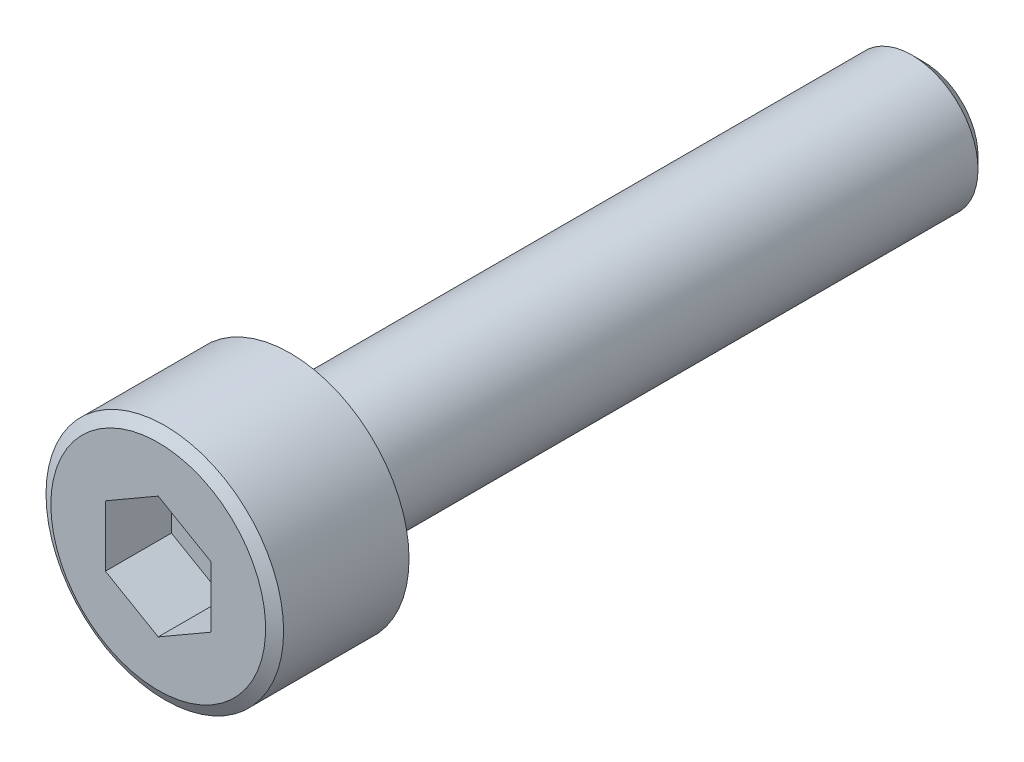
ISO-10303-21;
HEADER;
FILE_DESCRIPTION(('STEP AP214'),'2;1');
FILE_NAME('part.step','',(''),(''),'','','');
FILE_SCHEMA(('AUTOMOTIVE_DESIGN { 1 0 10303 214 1 1 1 1 }'));
ENDSEC;
DATA;
#1=APPLICATION_CONTEXT('core data for automotive mechanical design processes');
#2=APPLICATION_PROTOCOL_DEFINITION('international standard','automotive_design',2000,#1);
#3=PRODUCT_CONTEXT('',#1,'mechanical');
#4=PRODUCT('Part','Part','',(#3));
#5=PRODUCT_RELATED_PRODUCT_CATEGORY('part','',(#4));
#6=PRODUCT_DEFINITION_FORMATION('','',#4);
#7=PRODUCT_DEFINITION_CONTEXT('part definition',#1,'design');
#8=PRODUCT_DEFINITION('design','',#6,#7);
#9=PRODUCT_DEFINITION_SHAPE('','',#8);
#10=(LENGTH_UNIT() NAMED_UNIT(*) SI_UNIT(.MILLI.,.METRE.));
#11=(NAMED_UNIT(*) PLANE_ANGLE_UNIT() SI_UNIT($,.RADIAN.));
#12=(NAMED_UNIT(*) SI_UNIT($,.STERADIAN.) SOLID_ANGLE_UNIT());
#13=UNCERTAINTY_MEASURE_WITH_UNIT(LENGTH_MEASURE(1.E-05),#10,'distance_accuracy_value','');
#14=(GEOMETRIC_REPRESENTATION_CONTEXT(3) GLOBAL_UNCERTAINTY_ASSIGNED_CONTEXT((#13)) GLOBAL_UNIT_ASSIGNED_CONTEXT((#10,
#11,#12)) REPRESENTATION_CONTEXT('',''));
#15=CARTESIAN_POINT('',(0.,0.,0.));
#16=DIRECTION('',(0.,0.,1.));
#17=DIRECTION('',(1.,0.,0.));
#18=AXIS2_PLACEMENT_3D('',#15,#16,#17);
#19=CARTESIAN_POINT('',(0.,0.,1.25));
#20=DIRECTION('',(0.,0.,1.));
#21=DIRECTION('',(1.,0.,0.));
#22=AXIS2_PLACEMENT_3D('',#19,#20,#21);
#23=PLANE('',#22);
#24=DIRECTION('',(-0.866025403784429,0.500000000000017,0.));
#25=VECTOR('',#24,1.);
#26=CARTESIAN_POINT('',(1.,0.5773502691896,1.25));
#27=LINE('',#26,#25);
#28=CARTESIAN_POINT('',(1.,0.5773502691896,1.25));
#29=VERTEX_POINT('',#28);
#30=CARTESIAN_POINT('',(0.,1.15470053837905,1.25));
#31=VERTEX_POINT('',#30);
#32=EDGE_CURVE('E74',#29,#31,#27,.T.);
#33=ORIENTED_EDGE('',*,*,#32,.T.);
#34=DIRECTION('',(-0.866025403784429,-0.500000000000017,0.));
#35=VECTOR('',#34,1.);
#36=CARTESIAN_POINT('',(0.,1.154700538379,1.25));
#37=LINE('',#36,#35);
#38=CARTESIAN_POINT('',(-0.999999999999946,0.577350269189506,1.25));
#39=VERTEX_POINT('',#38);
#40=EDGE_CURVE('E71',#31,#39,#37,.T.);
#41=ORIENTED_EDGE('',*,*,#40,.T.);
#42=DIRECTION('',(0.,1.,0.));
#43=VECTOR('',#42,1.);
#44=CARTESIAN_POINT('',(-1.,0.5773502691896,1.25));
#45=LINE('',#44,#43);
#46=CARTESIAN_POINT('',(-1.,-0.5773502691896,1.25));
#47=VERTEX_POINT('',#46);
#48=EDGE_CURVE('E68',#39,#47,#45,.F.);
#49=ORIENTED_EDGE('',*,*,#48,.T.);
#50=DIRECTION('',(0.866025403784429,-0.500000000000017,0.));
#51=VECTOR('',#50,1.);
#52=CARTESIAN_POINT('',(-1.,-0.5773502691896,1.25));
#53=LINE('',#52,#51);
#54=CARTESIAN_POINT('',(0.,-1.15470053837909,1.25));
#55=VERTEX_POINT('',#54);
#56=EDGE_CURVE('E91',#47,#55,#53,.T.);
#57=ORIENTED_EDGE('',*,*,#56,.T.);
#58=DIRECTION('',(0.866025403784429,0.500000000000017,0.));
#59=VECTOR('',#58,1.);
#60=CARTESIAN_POINT('',(0.,-1.154700538379,1.25));
#61=LINE('',#60,#59);
#62=CARTESIAN_POINT('',(0.999999999999946,-0.577350269189506,1.25));
#63=VERTEX_POINT('',#62);
#64=EDGE_CURVE('E130',#55,#63,#61,.T.);
#65=ORIENTED_EDGE('',*,*,#64,.T.);
#66=DIRECTION('',(0.,1.,0.));
#67=VECTOR('',#66,1.);
#68=CARTESIAN_POINT('',(1.,-0.5773502691896,1.25));
#69=LINE('',#68,#67);
#70=EDGE_CURVE('E125',#63,#29,#69,.T.);
#71=ORIENTED_EDGE('',*,*,#70,.T.);
#72=EDGE_LOOP('',(#33,#41,#49,#57,#65,#71));
#73=FACE_BOUND('',#72,.T.);
#74=ADVANCED_FACE('F17',(#73),#23,.T.);
#75=CARTESIAN_POINT('',(0.,1.154700538379,2.5));
#76=DIRECTION('',(-0.500000000000017,0.866025403784429,0.));
#77=DIRECTION('',(-0.866025403784429,-0.500000000000017,0.));
#78=AXIS2_PLACEMENT_3D('',#75,#76,#77);
#79=PLANE('',#78);
#80=ORIENTED_EDGE('',*,*,#40,.F.);
#81=DIRECTION('',(0.,0.,1.));
#82=VECTOR('',#81,1.);
#83=CARTESIAN_POINT('',(1.08637057683048E-13,1.15470053837919,2.5));
#84=LINE('',#83,#82);
#85=CARTESIAN_POINT('',(0.,1.15470053837905,2.5));
#86=VERTEX_POINT('',#85);
#87=EDGE_CURVE('E120',#31,#86,#84,.T.);
#88=ORIENTED_EDGE('',*,*,#87,.T.);
#89=DIRECTION('',(-0.866025403784523,-0.499999999999853,0.));
#90=VECTOR('',#89,1.);
#91=CARTESIAN_POINT('',(0.,1.154700538379,2.5));
#92=LINE('',#91,#90);
#93=CARTESIAN_POINT('',(-0.999999999999946,0.577350269189506,2.5));
#94=VERTEX_POINT('',#93);
#95=EDGE_CURVE('E82',#86,#94,#92,.T.);
#96=ORIENTED_EDGE('',*,*,#95,.T.);
#97=DIRECTION('',(0.,0.,1.));
#98=VECTOR('',#97,1.);
#99=CARTESIAN_POINT('',(-1.,0.5773502691896,2.5));
#100=LINE('',#99,#98);
#101=EDGE_CURVE('E77',#94,#39,#100,.F.);
#102=ORIENTED_EDGE('',*,*,#101,.T.);
#103=EDGE_LOOP('',(#80,#88,#96,#102));
#104=FACE_BOUND('',#103,.T.);
#105=ADVANCED_FACE('F80',(#104),#79,.F.);
#106=CARTESIAN_POINT('',(-1.,0.5773502691896,2.5));
#107=DIRECTION('',(-1.,0.,0.));
#108=DIRECTION('',(0.,0.,1.));
#109=AXIS2_PLACEMENT_3D('',#106,#107,#108);
#110=PLANE('',#109);
#111=ORIENTED_EDGE('',*,*,#48,.F.);
#112=ORIENTED_EDGE('',*,*,#101,.F.);
#113=DIRECTION('',(0.,1.,0.));
#114=VECTOR('',#113,1.);
#115=CARTESIAN_POINT('',(-1.,0.,2.5));
#116=LINE('',#115,#114);
#117=CARTESIAN_POINT('',(-1.,-0.5773502691896,2.5));
#118=VERTEX_POINT('',#117);
#119=EDGE_CURVE('E117',#94,#118,#116,.F.);
#120=ORIENTED_EDGE('',*,*,#119,.T.);
#121=DIRECTION('',(0.,0.,1.));
#122=VECTOR('',#121,1.);
#123=CARTESIAN_POINT('',(-1.,-0.5773502691896,2.5));
#124=LINE('',#123,#122);
#125=EDGE_CURVE('E88',#118,#47,#124,.F.);
#126=ORIENTED_EDGE('',*,*,#125,.T.);
#127=EDGE_LOOP('',(#111,#112,#120,#126));
#128=FACE_BOUND('',#127,.T.);
#129=ADVANCED_FACE('F86',(#128),#110,.F.);
#130=CARTESIAN_POINT('',(-1.,-0.5773502691896,2.5));
#131=DIRECTION('',(-0.500000000000017,-0.866025403784429,0.));
#132=DIRECTION('',(0.866025403784429,-0.500000000000017,0.));
#133=AXIS2_PLACEMENT_3D('',#130,#131,#132);
#134=PLANE('',#133);
#135=ORIENTED_EDGE('',*,*,#56,.F.);
#136=ORIENTED_EDGE('',*,*,#125,.F.);
#137=DIRECTION('',(0.866025403784523,-0.499999999999853,0.));
#138=VECTOR('',#137,1.);
#139=CARTESIAN_POINT('',(-1.,-0.5773502691896,2.5));
#140=LINE('',#139,#138);
#141=CARTESIAN_POINT('',(0.,-1.15470053837909,2.5));
#142=VERTEX_POINT('',#141);
#143=EDGE_CURVE('E115',#118,#142,#140,.T.);
#144=ORIENTED_EDGE('',*,*,#143,.T.);
#145=DIRECTION('',(0.,0.,1.));
#146=VECTOR('',#145,1.);
#147=CARTESIAN_POINT('',(0.,-1.154700538379,2.5));
#148=LINE('',#147,#146);
#149=EDGE_CURVE('E132',#142,#55,#148,.F.);
#150=ORIENTED_EDGE('',*,*,#149,.T.);
#151=EDGE_LOOP('',(#135,#136,#144,#150));
#152=FACE_BOUND('',#151,.T.);
#153=ADVANCED_FACE('F137',(#152),#134,.F.);
#154=CARTESIAN_POINT('',(0.,-1.154700538379,2.5));
#155=DIRECTION('',(0.500000000000017,-0.866025403784429,0.));
#156=DIRECTION('',(0.866025403784429,0.500000000000017,0.));
#157=AXIS2_PLACEMENT_3D('',#154,#155,#156);
#158=PLANE('',#157);
#159=ORIENTED_EDGE('',*,*,#64,.F.);
#160=ORIENTED_EDGE('',*,*,#149,.F.);
#161=DIRECTION('',(0.866025403784523,0.499999999999853,0.));
#162=VECTOR('',#161,1.);
#163=CARTESIAN_POINT('',(0.,-1.154700538379,2.5));
#164=LINE('',#163,#162);
#165=CARTESIAN_POINT('',(0.999999999999946,-0.577350269189506,2.5));
#166=VERTEX_POINT('',#165);
#167=EDGE_CURVE('E113',#142,#166,#164,.T.);
#168=ORIENTED_EDGE('',*,*,#167,.T.);
#169=DIRECTION('',(0.,0.,-1.));
#170=VECTOR('',#169,1.);
#171=CARTESIAN_POINT('',(1.,-0.5773502691896,2.5));
#172=LINE('',#171,#170);
#173=EDGE_CURVE('E127',#166,#63,#172,.T.);
#174=ORIENTED_EDGE('',*,*,#173,.T.);
#175=EDGE_LOOP('',(#159,#160,#168,#174));
#176=FACE_BOUND('',#175,.T.);
#177=ADVANCED_FACE('F141',(#176),#158,.F.);
#178=CARTESIAN_POINT('',(1.,-0.5773502691896,2.5));
#179=DIRECTION('',(1.,0.,0.));
#180=DIRECTION('',(0.,0.,-1.));
#181=AXIS2_PLACEMENT_3D('',#178,#179,#180);
#182=PLANE('',#181);
#183=ORIENTED_EDGE('',*,*,#70,.F.);
#184=ORIENTED_EDGE('',*,*,#173,.F.);
#185=DIRECTION('',(0.,1.,0.));
#186=VECTOR('',#185,1.);
#187=CARTESIAN_POINT('',(1.,0.,2.5));
#188=LINE('',#187,#186);
#189=CARTESIAN_POINT('',(1.,0.5773502691896,2.5));
#190=VERTEX_POINT('',#189);
#191=EDGE_CURVE('E35',#166,#190,#188,.T.);
#192=ORIENTED_EDGE('',*,*,#191,.T.);
#193=DIRECTION('',(0.,0.,1.));
#194=VECTOR('',#193,1.);
#195=CARTESIAN_POINT('',(1.,0.5773502691896,2.5));
#196=LINE('',#195,#194);
#197=EDGE_CURVE('E123',#190,#29,#196,.F.);
#198=ORIENTED_EDGE('',*,*,#197,.T.);
#199=EDGE_LOOP('',(#183,#184,#192,#198));
#200=FACE_BOUND('',#199,.T.);
#201=ADVANCED_FACE('F143',(#200),#182,.F.);
#202=CARTESIAN_POINT('',(1.,0.5773502691896,2.5));
#203=DIRECTION('',(0.500000000000017,0.866025403784429,0.));
#204=DIRECTION('',(-0.866025403784429,0.500000000000017,0.));
#205=AXIS2_PLACEMENT_3D('',#202,#203,#204);
#206=PLANE('',#205);
#207=ORIENTED_EDGE('',*,*,#32,.F.);
#208=ORIENTED_EDGE('',*,*,#197,.F.);
#209=DIRECTION('',(-0.866025403784523,0.499999999999853,0.));
#210=VECTOR('',#209,1.);
#211=CARTESIAN_POINT('',(1.,0.5773502691896,2.5));
#212=LINE('',#211,#210);
#213=EDGE_CURVE('E107',#190,#86,#212,.T.);
#214=ORIENTED_EDGE('',*,*,#213,.T.);
#215=ORIENTED_EDGE('',*,*,#87,.F.);
#216=EDGE_LOOP('',(#207,#208,#214,#215));
#217=FACE_BOUND('',#216,.T.);
#218=ADVANCED_FACE('F146',(#217),#206,.F.);
#219=CARTESIAN_POINT('',(0.,0.,2.5));
#220=DIRECTION('',(0.,0.,-1.));
#221=DIRECTION('',(-1.,0.,0.));
#222=AXIS2_PLACEMENT_3D('',#219,#220,#221);
#223=PLANE('',#222);
#224=ORIENTED_EDGE('',*,*,#191,.F.);
#225=ORIENTED_EDGE('',*,*,#167,.F.);
#226=ORIENTED_EDGE('',*,*,#143,.F.);
#227=ORIENTED_EDGE('',*,*,#119,.F.);
#228=ORIENTED_EDGE('',*,*,#95,.F.);
#229=ORIENTED_EDGE('',*,*,#213,.F.);
#230=EDGE_LOOP('',(#224,#225,#226,#227,#228,#229));
#231=FACE_BOUND('',#230,.T.);
#232=CARTESIAN_POINT('',(0.,0.,2.49999999993209));
#233=DIRECTION('',(0.,0.,-1.));
#234=DIRECTION('',(-1.,0.,0.));
#235=AXIS2_PLACEMENT_3D('',#232,#233,#234);
#236=CIRCLE('',#235,2.03349364903715);
#237=CARTESIAN_POINT('',(-2.03349364903715,0.,2.49999999993209));
#238=VERTEX_POINT('',#237);
#239=EDGE_CURVE('E20',#238,#238,#236,.T.);
#240=ORIENTED_EDGE('',*,*,#239,.F.);
#241=EDGE_LOOP('',(#240));
#242=FACE_BOUND('',#241,.T.);
#243=ADVANCED_FACE('F148',(#231,#242),#223,.F.);
#244=CARTESIAN_POINT('',(0.,0.,2.3750000000291));
#245=DIRECTION('',(0.,0.,-1.));
#246=DIRECTION('',(-1.,0.,0.));
#247=AXIS2_PLACEMENT_3D('',#244,#245,#246);
#248=CONICAL_SURFACE('',#247,2.24999999983311,1.04719755123235);
#249=ORIENTED_EDGE('',*,*,#239,.T.);
#250=EDGE_LOOP('',(#249));
#251=FACE_BOUND('',#250,.T.);
#252=CARTESIAN_POINT('',(0.,0.,2.375));
#253=DIRECTION('',(0.,0.,-1.));
#254=DIRECTION('',(-1.,0.,0.));
#255=AXIS2_PLACEMENT_3D('',#252,#253,#254);
#256=CIRCLE('',#255,2.25);
#257=CARTESIAN_POINT('',(-2.25,0.,2.375));
#258=VERTEX_POINT('',#257);
#259=EDGE_CURVE('E99',#258,#258,#256,.T.);
#260=ORIENTED_EDGE('',*,*,#259,.F.);
#261=EDGE_LOOP('',(#260));
#262=FACE_BOUND('',#261,.T.);
#263=ADVANCED_FACE('F151',(#251,#262),#248,.T.);
#264=CARTESIAN_POINT('',(0.,0.,3.225));
#265=DIRECTION('',(0.,0.,-1.));
#266=DIRECTION('',(-1.,0.,0.));
#267=AXIS2_PLACEMENT_3D('',#264,#265,#266);
#268=CYLINDRICAL_SURFACE('',#267,2.25);
#269=CARTESIAN_POINT('',(0.,0.,0.));
#270=DIRECTION('',(0.,0.,-1.));
#271=DIRECTION('',(-1.,0.,0.));
#272=AXIS2_PLACEMENT_3D('',#269,#270,#271);
#273=CIRCLE('',#272,2.25);
#274=CARTESIAN_POINT('',(-2.25,0.,0.));
#275=VERTEX_POINT('',#274);
#276=EDGE_CURVE('E97',#275,#275,#273,.T.);
#277=ORIENTED_EDGE('',*,*,#276,.F.);
#278=EDGE_LOOP('',(#277));
#279=FACE_BOUND('',#278,.T.);
#280=ORIENTED_EDGE('',*,*,#259,.T.);
#281=EDGE_LOOP('',(#280));
#282=FACE_BOUND('',#281,.T.);
#283=ADVANCED_FACE('F157',(#279,#282),#268,.T.);
#284=CARTESIAN_POINT('',(0.,0.,-12.));
#285=DIRECTION('',(0.,0.,-1.));
#286=DIRECTION('',(-1.,0.,0.));
#287=AXIS2_PLACEMENT_3D('',#284,#285,#286);
#288=PLANE('',#287);
#289=CARTESIAN_POINT('',(0.,0.,-12.0000000000005));
#290=DIRECTION('',(0.,0.,1.));
#291=DIRECTION('',(1.,0.,0.));
#292=AXIS2_PLACEMENT_3D('',#289,#290,#291);
#293=CIRCLE('',#292,1.02500000002692);
#294=CARTESIAN_POINT('',(1.02500000002692,0.,-12.0000000000005));
#295=VERTEX_POINT('',#294);
#296=EDGE_CURVE('E95',#295,#295,#293,.T.);
#297=ORIENTED_EDGE('',*,*,#296,.F.);
#298=EDGE_LOOP('',(#297));
#299=FACE_BOUND('',#298,.T.);
#300=ADVANCED_FACE('F163',(#299),#288,.T.);
#301=CARTESIAN_POINT('',(0.,0.,0.));
#302=DIRECTION('',(0.,0.,-1.));
#303=DIRECTION('',(-1.,0.,0.));
#304=AXIS2_PLACEMENT_3D('',#301,#302,#303);
#305=PLANE('',#304);
#306=CARTESIAN_POINT('',(0.,0.,0.));
#307=DIRECTION('',(0.,0.,-1.));
#308=DIRECTION('',(-1.,0.,0.));
#309=AXIS2_PLACEMENT_3D('',#306,#307,#308);
#310=CIRCLE('',#309,1.25);
#311=CARTESIAN_POINT('',(-1.25,0.,0.));
#312=VERTEX_POINT('',#311);
#313=EDGE_CURVE('E11',#312,#312,#310,.T.);
#314=ORIENTED_EDGE('',*,*,#313,.F.);
#315=EDGE_LOOP('',(#314));
#316=FACE_BOUND('',#315,.T.);
#317=ORIENTED_EDGE('',*,*,#276,.T.);
#318=EDGE_LOOP('',(#317));
#319=FACE_BOUND('',#318,.T.);
#320=ADVANCED_FACE('F174',(#316,#319),#305,.T.);
#321=CARTESIAN_POINT('',(0.,0.,-11.7749999999432));
#322=DIRECTION('',(0.,0.,1.));
#323=DIRECTION('',(1.,0.,0.));
#324=AXIS2_PLACEMENT_3D('',#321,#322,#323);
#325=CONICAL_SURFACE('',#324,1.25000000002728,0.78539816327113);
#326=CARTESIAN_POINT('',(0.,0.,-11.775));
#327=DIRECTION('',(0.,0.,-1.));
#328=DIRECTION('',(-1.,0.,0.));
#329=AXIS2_PLACEMENT_3D('',#326,#327,#328);
#330=CIRCLE('',#329,1.25);
#331=CARTESIAN_POINT('',(-1.25,0.,-11.775));
#332=VERTEX_POINT('',#331);
#333=EDGE_CURVE('E26',#332,#332,#330,.F.);
#334=ORIENTED_EDGE('',*,*,#333,.F.);
#335=EDGE_LOOP('',(#334));
#336=FACE_BOUND('',#335,.T.);
#337=ORIENTED_EDGE('',*,*,#296,.T.);
#338=EDGE_LOOP('',(#337));
#339=FACE_BOUND('',#338,.T.);
#340=ADVANCED_FACE('F168',(#336,#339),#325,.T.);
#341=CARTESIAN_POINT('',(0.,0.,3.225));
#342=DIRECTION('',(0.,0.,-1.));
#343=DIRECTION('',(-1.,0.,0.));
#344=AXIS2_PLACEMENT_3D('',#341,#342,#343);
#345=CYLINDRICAL_SURFACE('',#344,1.25);
#346=ORIENTED_EDGE('',*,*,#313,.T.);
#347=EDGE_LOOP('',(#346));
#348=FACE_BOUND('',#347,.T.);
#349=ORIENTED_EDGE('',*,*,#333,.T.);
#350=EDGE_LOOP('',(#349));
#351=FACE_BOUND('',#350,.T.);
#352=ADVANCED_FACE('F166',(#348,#351),#345,.T.);
#353=CLOSED_SHELL('',(#74,#105,#129,#153,#177,#201,#218,#243,#263,#283,#300,#320,#340,#352));
#354=MANIFOLD_SOLID_BREP('B1',#353);
#355=ADVANCED_BREP_SHAPE_REPRESENTATION('',(#18,#354),#14);
#356=SHAPE_DEFINITION_REPRESENTATION(#9,#355);
ENDSEC;
END-ISO-10303-21;
